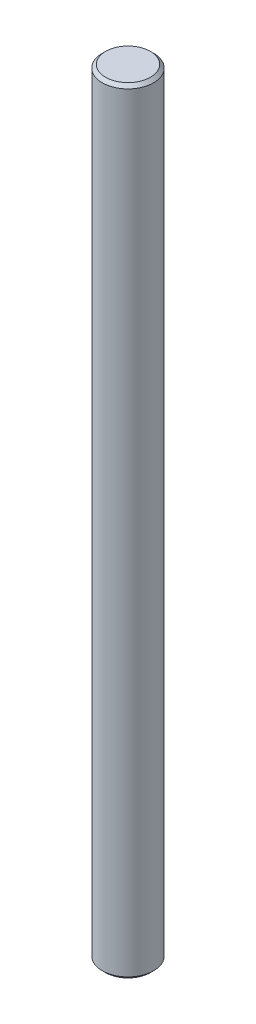
ISO-10303-21;
HEADER;
FILE_DESCRIPTION(('STEP AP214'),'2;1');
FILE_NAME('part.step','',(''),(''),'','','');
FILE_SCHEMA(('AUTOMOTIVE_DESIGN { 1 0 10303 214 1 1 1 1 }'));
ENDSEC;
DATA;
#1=APPLICATION_CONTEXT('core data for automotive mechanical design processes');
#2=APPLICATION_PROTOCOL_DEFINITION('international standard','automotive_design',2000,#1);
#3=PRODUCT_CONTEXT('',#1,'mechanical');
#4=PRODUCT('Part','Part','',(#3));
#5=PRODUCT_RELATED_PRODUCT_CATEGORY('part','',(#4));
#6=PRODUCT_DEFINITION_FORMATION('','',#4);
#7=PRODUCT_DEFINITION_CONTEXT('part definition',#1,'design');
#8=PRODUCT_DEFINITION('design','',#6,#7);
#9=PRODUCT_DEFINITION_SHAPE('','',#8);
#10=(LENGTH_UNIT() NAMED_UNIT(*) SI_UNIT(.MILLI.,.METRE.));
#11=(NAMED_UNIT(*) PLANE_ANGLE_UNIT() SI_UNIT($,.RADIAN.));
#12=(NAMED_UNIT(*) SI_UNIT($,.STERADIAN.) SOLID_ANGLE_UNIT());
#13=UNCERTAINTY_MEASURE_WITH_UNIT(LENGTH_MEASURE(1.E-05),#10,'distance_accuracy_value','');
#14=(GEOMETRIC_REPRESENTATION_CONTEXT(3) GLOBAL_UNCERTAINTY_ASSIGNED_CONTEXT((#13)) GLOBAL_UNIT_ASSIGNED_CONTEXT((#10,
#11,#12)) REPRESENTATION_CONTEXT('',''));
#15=CARTESIAN_POINT('',(0.,0.,0.));
#16=DIRECTION('',(0.,0.,1.));
#17=DIRECTION('',(1.,0.,0.));
#18=AXIS2_PLACEMENT_3D('',#15,#16,#17);
#19=CARTESIAN_POINT('',(0.,121.,0.));
#20=DIRECTION('',(0.,-1.,0.));
#21=DIRECTION('',(0.,0.,-1.));
#22=AXIS2_PLACEMENT_3D('',#19,#20,#21);
#23=CYLINDRICAL_SURFACE('',#22,4.);
#24=CARTESIAN_POINT('',(0.,0.5,0.));
#25=DIRECTION('',(0.,1.,0.));
#26=DIRECTION('',(0.,0.,1.));
#27=AXIS2_PLACEMENT_3D('',#24,#25,#26);
#28=CIRCLE('',#27,4.);
#29=CARTESIAN_POINT('',(0.,0.5,4.));
#30=VERTEX_POINT('',#29);
#31=EDGE_CURVE('E43',#30,#30,#28,.T.);
#32=ORIENTED_EDGE('',*,*,#31,.T.);
#33=EDGE_LOOP('',(#32));
#34=FACE_BOUND('',#33,.T.);
#35=CARTESIAN_POINT('',(0.,120.5,0.));
#36=DIRECTION('',(0.,1.,0.));
#37=DIRECTION('',(0.,0.,1.));
#38=AXIS2_PLACEMENT_3D('',#35,#36,#37);
#39=CIRCLE('',#38,4.);
#40=CARTESIAN_POINT('',(0.,120.5,4.));
#41=VERTEX_POINT('',#40);
#42=EDGE_CURVE('E47',#41,#41,#39,.F.);
#43=ORIENTED_EDGE('',*,*,#42,.T.);
#44=EDGE_LOOP('',(#43));
#45=FACE_BOUND('',#44,.T.);
#46=ADVANCED_FACE('F32',(#34,#45),#23,.T.);
#47=CARTESIAN_POINT('',(0.,121.,0.));
#48=DIRECTION('',(0.,1.,0.));
#49=DIRECTION('',(0.,0.,1.));
#50=AXIS2_PLACEMENT_3D('',#47,#48,#49);
#51=PLANE('',#50);
#52=CARTESIAN_POINT('',(0.,121.,0.));
#53=DIRECTION('',(0.,1.,0.));
#54=DIRECTION('',(0.,0.,1.));
#55=AXIS2_PLACEMENT_3D('',#52,#53,#54);
#56=CIRCLE('',#55,3.5);
#57=CARTESIAN_POINT('',(0.,121.,3.5));
#58=VERTEX_POINT('',#57);
#59=EDGE_CURVE('E10',#58,#58,#56,.T.);
#60=ORIENTED_EDGE('',*,*,#59,.T.);
#61=EDGE_LOOP('',(#60));
#62=FACE_BOUND('',#61,.T.);
#63=ADVANCED_FACE('F63',(#62),#51,.T.);
#64=CARTESIAN_POINT('',(0.,0.,0.));
#65=DIRECTION('',(0.,1.,0.));
#66=DIRECTION('',(0.,0.,1.));
#67=AXIS2_PLACEMENT_3D('',#64,#65,#66);
#68=PLANE('',#67);
#69=CARTESIAN_POINT('',(0.,0.,0.));
#70=DIRECTION('',(0.,1.,0.));
#71=DIRECTION('',(0.,0.,1.));
#72=AXIS2_PLACEMENT_3D('',#69,#70,#71);
#73=CIRCLE('',#72,3.5);
#74=CARTESIAN_POINT('',(0.,0.,3.5));
#75=VERTEX_POINT('',#74);
#76=EDGE_CURVE('E39',#75,#75,#73,.F.);
#77=ORIENTED_EDGE('',*,*,#76,.T.);
#78=EDGE_LOOP('',(#77));
#79=FACE_BOUND('',#78,.T.);
#80=ADVANCED_FACE('F60',(#79),#68,.F.);
#81=CARTESIAN_POINT('',(0.,0.5,0.));
#82=DIRECTION('',(0.,1.,0.));
#83=DIRECTION('',(0.,0.,1.));
#84=AXIS2_PLACEMENT_3D('',#81,#82,#83);
#85=CONICAL_SURFACE('',#84,4.,0.785398163397445);
#86=ORIENTED_EDGE('',*,*,#76,.F.);
#87=EDGE_LOOP('',(#86));
#88=FACE_BOUND('',#87,.T.);
#89=ORIENTED_EDGE('',*,*,#31,.F.);
#90=EDGE_LOOP('',(#89));
#91=FACE_BOUND('',#90,.T.);
#92=ADVANCED_FACE('F56',(#88,#91),#85,.T.);
#93=CARTESIAN_POINT('',(0.,121.,0.));
#94=DIRECTION('',(0.,-1.,0.));
#95=DIRECTION('',(0.,0.,-1.));
#96=AXIS2_PLACEMENT_3D('',#93,#94,#95);
#97=CONICAL_SURFACE('',#96,3.5,0.785398163397459);
#98=ORIENTED_EDGE('',*,*,#42,.F.);
#99=EDGE_LOOP('',(#98));
#100=FACE_BOUND('',#99,.T.);
#101=ORIENTED_EDGE('',*,*,#59,.F.);
#102=EDGE_LOOP('',(#101));
#103=FACE_BOUND('',#102,.T.);
#104=ADVANCED_FACE('F34',(#100,#103),#97,.T.);
#105=CLOSED_SHELL('',(#46,#63,#80,#92,#104));
#106=MANIFOLD_SOLID_BREP('B2',#105);
#107=ADVANCED_BREP_SHAPE_REPRESENTATION('',(#18,#106),#14);
#108=SHAPE_DEFINITION_REPRESENTATION(#9,#107);
ENDSEC;
END-ISO-10303-21;
